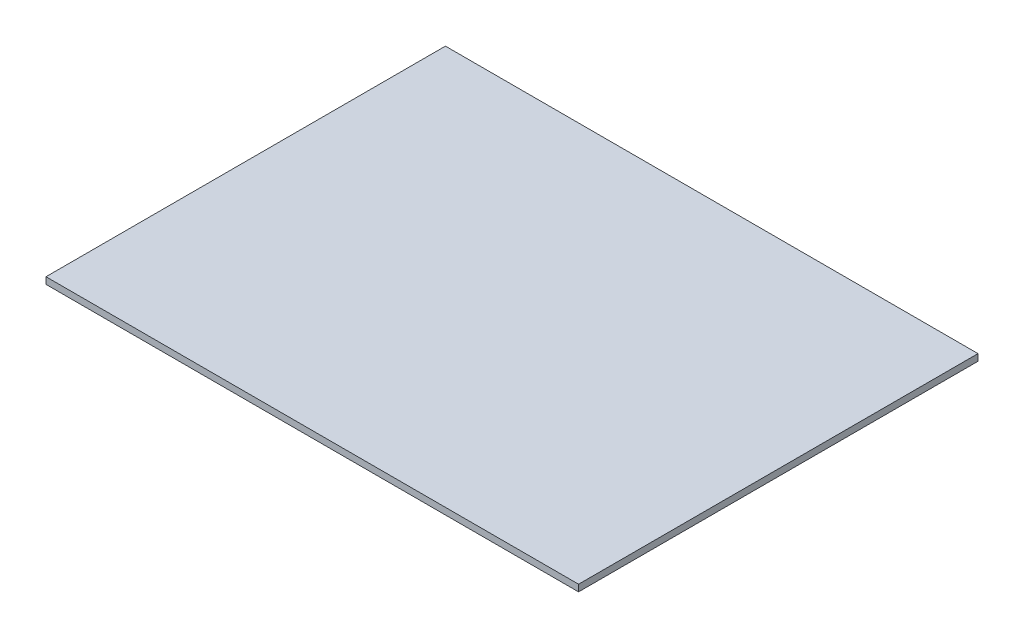
ISO-10303-21;
HEADER;
FILE_DESCRIPTION(('STEP AP214'),'2;1');
FILE_NAME('part.step','',(''),(''),'','','');
FILE_SCHEMA(('AUTOMOTIVE_DESIGN { 1 0 10303 214 1 1 1 1 }'));
ENDSEC;
DATA;
#1=APPLICATION_CONTEXT('core data for automotive mechanical design processes');
#2=APPLICATION_PROTOCOL_DEFINITION('international standard','automotive_design',2000,#1);
#3=PRODUCT_CONTEXT('',#1,'mechanical');
#4=PRODUCT('Part','Part','',(#3));
#5=PRODUCT_RELATED_PRODUCT_CATEGORY('part','',(#4));
#6=PRODUCT_DEFINITION_FORMATION('','',#4);
#7=PRODUCT_DEFINITION_CONTEXT('part definition',#1,'design');
#8=PRODUCT_DEFINITION('design','',#6,#7);
#9=PRODUCT_DEFINITION_SHAPE('','',#8);
#10=(LENGTH_UNIT() NAMED_UNIT(*) SI_UNIT(.MILLI.,.METRE.));
#11=(NAMED_UNIT(*) PLANE_ANGLE_UNIT() SI_UNIT($,.RADIAN.));
#12=(NAMED_UNIT(*) SI_UNIT($,.STERADIAN.) SOLID_ANGLE_UNIT());
#13=UNCERTAINTY_MEASURE_WITH_UNIT(LENGTH_MEASURE(1.E-05),#10,'distance_accuracy_value','');
#14=(GEOMETRIC_REPRESENTATION_CONTEXT(3) GLOBAL_UNCERTAINTY_ASSIGNED_CONTEXT((#13)) GLOBAL_UNIT_ASSIGNED_CONTEXT((#10,
#11,#12)) REPRESENTATION_CONTEXT('',''));
#15=CARTESIAN_POINT('',(0.,0.,0.));
#16=DIRECTION('',(0.,0.,1.));
#17=DIRECTION('',(1.,0.,0.));
#18=AXIS2_PLACEMENT_3D('',#15,#16,#17);
#19=CARTESIAN_POINT('',(0.,3.,0.));
#20=DIRECTION('',(1.,0.,0.));
#21=DIRECTION('',(0.,0.,-1.));
#22=AXIS2_PLACEMENT_3D('',#19,#20,#21);
#23=PLANE('',#22);
#24=DIRECTION('',(0.,0.,1.));
#25=VECTOR('',#24,1.);
#26=CARTESIAN_POINT('',(0.,0.,0.));
#27=LINE('',#26,#25);
#28=CARTESIAN_POINT('',(0.,0.,-180.));
#29=VERTEX_POINT('',#28);
#30=CARTESIAN_POINT('',(0.,0.,0.));
#31=VERTEX_POINT('',#30);
#32=EDGE_CURVE('E98',#29,#31,#27,.T.);
#33=ORIENTED_EDGE('',*,*,#32,.T.);
#34=DIRECTION('',(0.,-1.,0.));
#35=VECTOR('',#34,1.);
#36=CARTESIAN_POINT('',(0.,3.,0.));
#37=LINE('',#36,#35);
#38=CARTESIAN_POINT('',(0.,3.,0.));
#39=VERTEX_POINT('',#38);
#40=EDGE_CURVE('E11',#39,#31,#37,.T.);
#41=ORIENTED_EDGE('',*,*,#40,.F.);
#42=DIRECTION('',(0.,0.,1.));
#43=VECTOR('',#42,1.);
#44=CARTESIAN_POINT('',(0.,3.,0.));
#45=LINE('',#44,#43);
#46=CARTESIAN_POINT('',(0.,3.,-180.));
#47=VERTEX_POINT('',#46);
#48=EDGE_CURVE('E86',#47,#39,#45,.T.);
#49=ORIENTED_EDGE('',*,*,#48,.F.);
#50=DIRECTION('',(0.,-1.,0.));
#51=VECTOR('',#50,1.);
#52=CARTESIAN_POINT('',(0.,3.,-180.));
#53=LINE('',#52,#51);
#54=EDGE_CURVE('E94',#47,#29,#53,.T.);
#55=ORIENTED_EDGE('',*,*,#54,.T.);
#56=EDGE_LOOP('',(#33,#41,#49,#55));
#57=FACE_BOUND('',#56,.T.);
#58=ADVANCED_FACE('F35',(#57),#23,.F.);
#59=CARTESIAN_POINT('',(0.,3.,0.));
#60=DIRECTION('',(0.,0.,-1.));
#61=DIRECTION('',(-1.,0.,0.));
#62=AXIS2_PLACEMENT_3D('',#59,#60,#61);
#63=PLANE('',#62);
#64=DIRECTION('',(1.,0.,0.));
#65=VECTOR('',#64,1.);
#66=CARTESIAN_POINT('',(0.,0.,0.));
#67=LINE('',#66,#65);
#68=CARTESIAN_POINT('',(240.,0.,0.));
#69=VERTEX_POINT('',#68);
#70=EDGE_CURVE('E90',#31,#69,#67,.T.);
#71=ORIENTED_EDGE('',*,*,#70,.T.);
#72=DIRECTION('',(0.,-1.,0.));
#73=VECTOR('',#72,1.);
#74=CARTESIAN_POINT('',(240.,3.,0.));
#75=LINE('',#74,#73);
#76=CARTESIAN_POINT('',(240.,3.,0.));
#77=VERTEX_POINT('',#76);
#78=EDGE_CURVE('E43',#77,#69,#75,.T.);
#79=ORIENTED_EDGE('',*,*,#78,.F.);
#80=DIRECTION('',(1.,0.,0.));
#81=VECTOR('',#80,1.);
#82=CARTESIAN_POINT('',(0.,3.,0.));
#83=LINE('',#82,#81);
#84=EDGE_CURVE('E81',#39,#77,#83,.T.);
#85=ORIENTED_EDGE('',*,*,#84,.F.);
#86=ORIENTED_EDGE('',*,*,#40,.T.);
#87=EDGE_LOOP('',(#71,#79,#85,#86));
#88=FACE_BOUND('',#87,.T.);
#89=ADVANCED_FACE('F89',(#88),#63,.F.);
#90=CARTESIAN_POINT('',(240.,3.,0.));
#91=DIRECTION('',(-1.,0.,0.));
#92=DIRECTION('',(0.,0.,1.));
#93=AXIS2_PLACEMENT_3D('',#90,#91,#92);
#94=PLANE('',#93);
#95=DIRECTION('',(0.,0.,-1.));
#96=VECTOR('',#95,1.);
#97=CARTESIAN_POINT('',(240.,0.,0.));
#98=LINE('',#97,#96);
#99=CARTESIAN_POINT('',(240.,0.,-180.));
#100=VERTEX_POINT('',#99);
#101=EDGE_CURVE('E68',#69,#100,#98,.T.);
#102=ORIENTED_EDGE('',*,*,#101,.T.);
#103=DIRECTION('',(0.,-1.,0.));
#104=VECTOR('',#103,1.);
#105=CARTESIAN_POINT('',(240.,3.,-180.));
#106=LINE('',#105,#104);
#107=CARTESIAN_POINT('',(240.,3.,-180.));
#108=VERTEX_POINT('',#107);
#109=EDGE_CURVE('E91',#108,#100,#106,.T.);
#110=ORIENTED_EDGE('',*,*,#109,.F.);
#111=DIRECTION('',(0.,0.,-1.));
#112=VECTOR('',#111,1.);
#113=CARTESIAN_POINT('',(240.,3.,0.));
#114=LINE('',#113,#112);
#115=EDGE_CURVE('E84',#77,#108,#114,.T.);
#116=ORIENTED_EDGE('',*,*,#115,.F.);
#117=ORIENTED_EDGE('',*,*,#78,.T.);
#118=EDGE_LOOP('',(#102,#110,#116,#117));
#119=FACE_BOUND('',#118,.T.);
#120=ADVANCED_FACE('F92',(#119),#94,.F.);
#121=CARTESIAN_POINT('',(0.,3.,-180.));
#122=DIRECTION('',(0.,0.,1.));
#123=DIRECTION('',(1.,0.,0.));
#124=AXIS2_PLACEMENT_3D('',#121,#122,#123);
#125=PLANE('',#124);
#126=DIRECTION('',(-1.,0.,0.));
#127=VECTOR('',#126,1.);
#128=CARTESIAN_POINT('',(0.,0.,-180.));
#129=LINE('',#128,#127);
#130=EDGE_CURVE('E74',#100,#29,#129,.T.);
#131=ORIENTED_EDGE('',*,*,#130,.T.);
#132=ORIENTED_EDGE('',*,*,#54,.F.);
#133=DIRECTION('',(-1.,0.,0.));
#134=VECTOR('',#133,1.);
#135=CARTESIAN_POINT('',(0.,3.,-180.));
#136=LINE('',#135,#134);
#137=EDGE_CURVE('E51',#108,#47,#136,.T.);
#138=ORIENTED_EDGE('',*,*,#137,.F.);
#139=ORIENTED_EDGE('',*,*,#109,.T.);
#140=EDGE_LOOP('',(#131,#132,#138,#139));
#141=FACE_BOUND('',#140,.T.);
#142=ADVANCED_FACE('F105',(#141),#125,.F.);
#143=CARTESIAN_POINT('',(0.,3.,0.));
#144=DIRECTION('',(0.,-1.,0.));
#145=DIRECTION('',(0.,0.,-1.));
#146=AXIS2_PLACEMENT_3D('',#143,#144,#145);
#147=PLANE('',#146);
#148=ORIENTED_EDGE('',*,*,#48,.T.);
#149=ORIENTED_EDGE('',*,*,#84,.T.);
#150=ORIENTED_EDGE('',*,*,#115,.T.);
#151=ORIENTED_EDGE('',*,*,#137,.T.);
#152=EDGE_LOOP('',(#148,#149,#150,#151));
#153=FACE_BOUND('',#152,.T.);
#154=ADVANCED_FACE('F82',(#153),#147,.F.);
#155=CARTESIAN_POINT('',(0.,0.,0.));
#156=DIRECTION('',(0.,-1.,0.));
#157=DIRECTION('',(0.,0.,-1.));
#158=AXIS2_PLACEMENT_3D('',#155,#156,#157);
#159=PLANE('',#158);
#160=ORIENTED_EDGE('',*,*,#32,.F.);
#161=ORIENTED_EDGE('',*,*,#130,.F.);
#162=ORIENTED_EDGE('',*,*,#101,.F.);
#163=ORIENTED_EDGE('',*,*,#70,.F.);
#164=EDGE_LOOP('',(#160,#161,#162,#163));
#165=FACE_BOUND('',#164,.T.);
#166=ADVANCED_FACE('F108',(#165),#159,.T.);
#167=CLOSED_SHELL('',(#58,#89,#120,#142,#154,#166));
#168=MANIFOLD_SOLID_BREP('B2',#167);
#169=ADVANCED_BREP_SHAPE_REPRESENTATION('',(#18,#168),#14);
#170=SHAPE_DEFINITION_REPRESENTATION(#9,#169);
ENDSEC;
END-ISO-10303-21;
